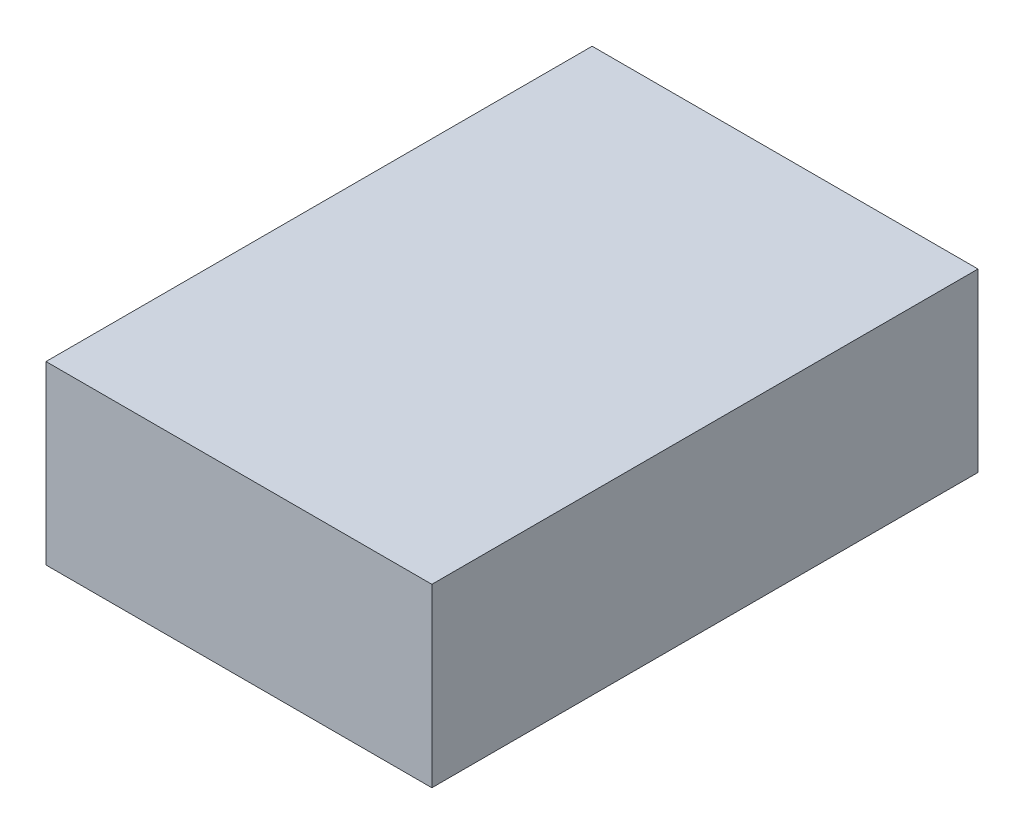
ISO-10303-21;
HEADER;
FILE_DESCRIPTION(('STEP AP214'),'2;1');
FILE_NAME('part.step','',(''),(''),'','','');
FILE_SCHEMA(('AUTOMOTIVE_DESIGN { 1 0 10303 214 1 1 1 1 }'));
ENDSEC;
DATA;
#1=APPLICATION_CONTEXT('core data for automotive mechanical design processes');
#2=APPLICATION_PROTOCOL_DEFINITION('international standard','automotive_design',2000,#1);
#3=PRODUCT_CONTEXT('',#1,'mechanical');
#4=PRODUCT('Part','Part','',(#3));
#5=PRODUCT_RELATED_PRODUCT_CATEGORY('part','',(#4));
#6=PRODUCT_DEFINITION_FORMATION('','',#4);
#7=PRODUCT_DEFINITION_CONTEXT('part definition',#1,'design');
#8=PRODUCT_DEFINITION('design','',#6,#7);
#9=PRODUCT_DEFINITION_SHAPE('','',#8);
#10=(LENGTH_UNIT() NAMED_UNIT(*) SI_UNIT(.MILLI.,.METRE.));
#11=(NAMED_UNIT(*) PLANE_ANGLE_UNIT() SI_UNIT($,.RADIAN.));
#12=(NAMED_UNIT(*) SI_UNIT($,.STERADIAN.) SOLID_ANGLE_UNIT());
#13=UNCERTAINTY_MEASURE_WITH_UNIT(LENGTH_MEASURE(1.E-05),#10,'distance_accuracy_value','');
#14=(GEOMETRIC_REPRESENTATION_CONTEXT(3) GLOBAL_UNCERTAINTY_ASSIGNED_CONTEXT((#13)) GLOBAL_UNIT_ASSIGNED_CONTEXT((#10,
#11,#12)) REPRESENTATION_CONTEXT('',''));
#15=CARTESIAN_POINT('',(0.,0.,0.));
#16=DIRECTION('',(0.,0.,1.));
#17=DIRECTION('',(1.,0.,0.));
#18=AXIS2_PLACEMENT_3D('',#15,#16,#17);
#19=CARTESIAN_POINT('',(-25.4,23.2,-35.95));
#20=DIRECTION('',(1.,0.,0.));
#21=DIRECTION('',(0.,0.,-1.));
#22=AXIS2_PLACEMENT_3D('',#19,#20,#21);
#23=PLANE('',#22);
#24=DIRECTION('',(0.,0.,1.));
#25=VECTOR('',#24,1.);
#26=CARTESIAN_POINT('',(-25.4,0.,-35.95));
#27=LINE('',#26,#25);
#28=CARTESIAN_POINT('',(-25.4,0.,-35.95));
#29=VERTEX_POINT('',#28);
#30=CARTESIAN_POINT('',(-25.4,0.,35.95));
#31=VERTEX_POINT('',#30);
#32=EDGE_CURVE('E100',#29,#31,#27,.T.);
#33=ORIENTED_EDGE('',*,*,#32,.T.);
#34=DIRECTION('',(0.,-1.,0.));
#35=VECTOR('',#34,1.);
#36=CARTESIAN_POINT('',(-25.4,23.2,35.95));
#37=LINE('',#36,#35);
#38=CARTESIAN_POINT('',(-25.4,23.2,35.95));
#39=VERTEX_POINT('',#38);
#40=EDGE_CURVE('E11',#39,#31,#37,.T.);
#41=ORIENTED_EDGE('',*,*,#40,.F.);
#42=DIRECTION('',(0.,0.,1.));
#43=VECTOR('',#42,1.);
#44=CARTESIAN_POINT('',(-25.4,23.2,-35.95));
#45=LINE('',#44,#43);
#46=CARTESIAN_POINT('',(-25.4,23.2,-35.95));
#47=VERTEX_POINT('',#46);
#48=EDGE_CURVE('E88',#47,#39,#45,.T.);
#49=ORIENTED_EDGE('',*,*,#48,.F.);
#50=DIRECTION('',(0.,-1.,0.));
#51=VECTOR('',#50,1.);
#52=CARTESIAN_POINT('',(-25.4,23.2,-35.95));
#53=LINE('',#52,#51);
#54=EDGE_CURVE('E96',#47,#29,#53,.T.);
#55=ORIENTED_EDGE('',*,*,#54,.T.);
#56=EDGE_LOOP('',(#33,#41,#49,#55));
#57=FACE_BOUND('',#56,.T.);
#58=ADVANCED_FACE('F37',(#57),#23,.F.);
#59=CARTESIAN_POINT('',(25.4,23.2,35.95));
#60=DIRECTION('',(0.,0.,-1.));
#61=DIRECTION('',(-1.,0.,0.));
#62=AXIS2_PLACEMENT_3D('',#59,#60,#61);
#63=PLANE('',#62);
#64=DIRECTION('',(1.,0.,0.));
#65=VECTOR('',#64,1.);
#66=CARTESIAN_POINT('',(25.4,0.,35.95));
#67=LINE('',#66,#65);
#68=CARTESIAN_POINT('',(25.4,0.,35.95));
#69=VERTEX_POINT('',#68);
#70=EDGE_CURVE('E92',#31,#69,#67,.T.);
#71=ORIENTED_EDGE('',*,*,#70,.T.);
#72=DIRECTION('',(0.,-1.,0.));
#73=VECTOR('',#72,1.);
#74=CARTESIAN_POINT('',(25.4,23.2,35.95));
#75=LINE('',#74,#73);
#76=CARTESIAN_POINT('',(25.4,23.2,35.95));
#77=VERTEX_POINT('',#76);
#78=EDGE_CURVE('E45',#77,#69,#75,.T.);
#79=ORIENTED_EDGE('',*,*,#78,.F.);
#80=DIRECTION('',(1.,0.,0.));
#81=VECTOR('',#80,1.);
#82=CARTESIAN_POINT('',(25.4,23.2,35.95));
#83=LINE('',#82,#81);
#84=EDGE_CURVE('E83',#39,#77,#83,.T.);
#85=ORIENTED_EDGE('',*,*,#84,.F.);
#86=ORIENTED_EDGE('',*,*,#40,.T.);
#87=EDGE_LOOP('',(#71,#79,#85,#86));
#88=FACE_BOUND('',#87,.T.);
#89=ADVANCED_FACE('F91',(#88),#63,.F.);
#90=CARTESIAN_POINT('',(25.4,23.2,-35.95));
#91=DIRECTION('',(-1.,0.,0.));
#92=DIRECTION('',(0.,0.,1.));
#93=AXIS2_PLACEMENT_3D('',#90,#91,#92);
#94=PLANE('',#93);
#95=DIRECTION('',(0.,0.,-1.));
#96=VECTOR('',#95,1.);
#97=CARTESIAN_POINT('',(25.4,0.,-35.95));
#98=LINE('',#97,#96);
#99=CARTESIAN_POINT('',(25.4,0.,-35.95));
#100=VERTEX_POINT('',#99);
#101=EDGE_CURVE('E70',#69,#100,#98,.T.);
#102=ORIENTED_EDGE('',*,*,#101,.T.);
#103=DIRECTION('',(0.,-1.,0.));
#104=VECTOR('',#103,1.);
#105=CARTESIAN_POINT('',(25.4,23.2,-35.95));
#106=LINE('',#105,#104);
#107=CARTESIAN_POINT('',(25.4,23.2,-35.95));
#108=VERTEX_POINT('',#107);
#109=EDGE_CURVE('E93',#108,#100,#106,.T.);
#110=ORIENTED_EDGE('',*,*,#109,.F.);
#111=DIRECTION('',(0.,0.,-1.));
#112=VECTOR('',#111,1.);
#113=CARTESIAN_POINT('',(25.4,23.2,-35.95));
#114=LINE('',#113,#112);
#115=EDGE_CURVE('E86',#77,#108,#114,.T.);
#116=ORIENTED_EDGE('',*,*,#115,.F.);
#117=ORIENTED_EDGE('',*,*,#78,.T.);
#118=EDGE_LOOP('',(#102,#110,#116,#117));
#119=FACE_BOUND('',#118,.T.);
#120=ADVANCED_FACE('F94',(#119),#94,.F.);
#121=CARTESIAN_POINT('',(25.4,23.2,-35.95));
#122=DIRECTION('',(0.,0.,1.));
#123=DIRECTION('',(1.,0.,0.));
#124=AXIS2_PLACEMENT_3D('',#121,#122,#123);
#125=PLANE('',#124);
#126=DIRECTION('',(-1.,0.,0.));
#127=VECTOR('',#126,1.);
#128=CARTESIAN_POINT('',(25.4,0.,-35.95));
#129=LINE('',#128,#127);
#130=EDGE_CURVE('E76',#100,#29,#129,.T.);
#131=ORIENTED_EDGE('',*,*,#130,.T.);
#132=ORIENTED_EDGE('',*,*,#54,.F.);
#133=DIRECTION('',(-1.,0.,0.));
#134=VECTOR('',#133,1.);
#135=CARTESIAN_POINT('',(25.4,23.2,-35.95));
#136=LINE('',#135,#134);
#137=EDGE_CURVE('E53',#108,#47,#136,.T.);
#138=ORIENTED_EDGE('',*,*,#137,.F.);
#139=ORIENTED_EDGE('',*,*,#109,.T.);
#140=EDGE_LOOP('',(#131,#132,#138,#139));
#141=FACE_BOUND('',#140,.T.);
#142=ADVANCED_FACE('F107',(#141),#125,.F.);
#143=CARTESIAN_POINT('',(0.,23.2,0.));
#144=DIRECTION('',(0.,-1.,0.));
#145=DIRECTION('',(0.,0.,-1.));
#146=AXIS2_PLACEMENT_3D('',#143,#144,#145);
#147=PLANE('',#146);
#148=ORIENTED_EDGE('',*,*,#48,.T.);
#149=ORIENTED_EDGE('',*,*,#84,.T.);
#150=ORIENTED_EDGE('',*,*,#115,.T.);
#151=ORIENTED_EDGE('',*,*,#137,.T.);
#152=EDGE_LOOP('',(#148,#149,#150,#151));
#153=FACE_BOUND('',#152,.T.);
#154=ADVANCED_FACE('F84',(#153),#147,.F.);
#155=CARTESIAN_POINT('',(0.,0.,0.));
#156=DIRECTION('',(0.,-1.,0.));
#157=DIRECTION('',(0.,0.,-1.));
#158=AXIS2_PLACEMENT_3D('',#155,#156,#157);
#159=PLANE('',#158);
#160=ORIENTED_EDGE('',*,*,#32,.F.);
#161=ORIENTED_EDGE('',*,*,#130,.F.);
#162=ORIENTED_EDGE('',*,*,#101,.F.);
#163=ORIENTED_EDGE('',*,*,#70,.F.);
#164=EDGE_LOOP('',(#160,#161,#162,#163));
#165=FACE_BOUND('',#164,.T.);
#166=ADVANCED_FACE('F110',(#165),#159,.T.);
#167=CLOSED_SHELL('',(#58,#89,#120,#142,#154,#166));
#168=MANIFOLD_SOLID_BREP('B2',#167);
#169=ADVANCED_BREP_SHAPE_REPRESENTATION('',(#18,#168),#14);
#170=SHAPE_DEFINITION_REPRESENTATION(#9,#169);
ENDSEC;
END-ISO-10303-21;
